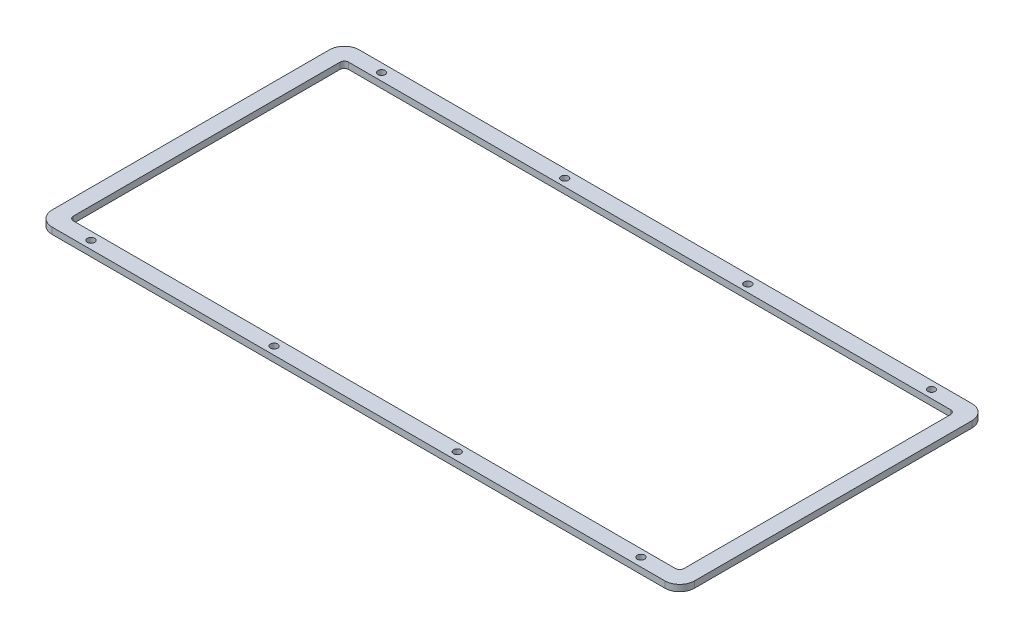
ISO-10303-21;
HEADER;
FILE_DESCRIPTION(('STEP AP214'),'2;1');
FILE_NAME('part.step','',(''),(''),'','','');
FILE_SCHEMA(('AUTOMOTIVE_DESIGN { 1 0 10303 214 1 1 1 1 }'));
ENDSEC;
DATA;
#1=APPLICATION_CONTEXT('core data for automotive mechanical design processes');
#2=APPLICATION_PROTOCOL_DEFINITION('international standard','automotive_design',2000,#1);
#3=PRODUCT_CONTEXT('',#1,'mechanical');
#4=PRODUCT('Part','Part','',(#3));
#5=PRODUCT_RELATED_PRODUCT_CATEGORY('part','',(#4));
#6=PRODUCT_DEFINITION_FORMATION('','',#4);
#7=PRODUCT_DEFINITION_CONTEXT('part definition',#1,'design');
#8=PRODUCT_DEFINITION('design','',#6,#7);
#9=PRODUCT_DEFINITION_SHAPE('','',#8);
#10=(LENGTH_UNIT() NAMED_UNIT(*) SI_UNIT(.MILLI.,.METRE.));
#11=(NAMED_UNIT(*) PLANE_ANGLE_UNIT() SI_UNIT($,.RADIAN.));
#12=(NAMED_UNIT(*) SI_UNIT($,.STERADIAN.) SOLID_ANGLE_UNIT());
#13=UNCERTAINTY_MEASURE_WITH_UNIT(LENGTH_MEASURE(1.E-05),#10,'distance_accuracy_value','');
#14=(GEOMETRIC_REPRESENTATION_CONTEXT(3) GLOBAL_UNCERTAINTY_ASSIGNED_CONTEXT((#13)) GLOBAL_UNIT_ASSIGNED_CONTEXT((#10,
#11,#12)) REPRESENTATION_CONTEXT('',''));
#15=CARTESIAN_POINT('',(0.,0.,0.));
#16=DIRECTION('',(0.,0.,1.));
#17=DIRECTION('',(1.,0.,0.));
#18=AXIS2_PLACEMENT_3D('',#15,#16,#17);
#19=CARTESIAN_POINT('',(0.,0.,0.));
#20=DIRECTION('',(0.,-1.,0.));
#21=DIRECTION('',(0.,0.,-1.));
#22=AXIS2_PLACEMENT_3D('',#19,#20,#21);
#23=PLANE('',#22);
#24=CARTESIAN_POINT('',(303.284579293257,0.,-34.6463811872234));
#25=DIRECTION('',(0.,-1.,0.));
#26=DIRECTION('',(0.,0.,-1.));
#27=AXIS2_PLACEMENT_3D('',#24,#25,#26);
#28=CIRCLE('',#27,1.69999999999992);
#29=CARTESIAN_POINT('',(303.284579293257,0.,-36.3463811872233));
#30=VERTEX_POINT('',#29);
#31=EDGE_CURVE('E43',#30,#30,#28,.T.);
#32=ORIENTED_EDGE('',*,*,#31,.F.);
#33=EDGE_LOOP('',(#32));
#34=FACE_BOUND('',#33,.T.);
#35=CARTESIAN_POINT('',(217.284579293257,0.,-34.3963811872234));
#36=DIRECTION('',(0.,-1.,0.));
#37=DIRECTION('',(0.,0.,-1.));
#38=AXIS2_PLACEMENT_3D('',#35,#36,#37);
#39=CIRCLE('',#38,1.70000000000001);
#40=CARTESIAN_POINT('',(217.284579293257,0.,-36.0963811872234));
#41=VERTEX_POINT('',#40);
#42=EDGE_CURVE('E318',#41,#41,#39,.T.);
#43=ORIENTED_EDGE('',*,*,#42,.F.);
#44=EDGE_LOOP('',(#43));
#45=FACE_BOUND('',#44,.T.);
#46=CARTESIAN_POINT('',(45.2845792932565,0.,-34.3963811872234));
#47=DIRECTION('',(0.,-1.,0.));
#48=DIRECTION('',(0.,0.,-1.));
#49=AXIS2_PLACEMENT_3D('',#46,#47,#48);
#50=CIRCLE('',#49,1.7);
#51=CARTESIAN_POINT('',(45.2845792932565,0.,-36.0963811872234));
#52=VERTEX_POINT('',#51);
#53=EDGE_CURVE('E316',#52,#52,#50,.T.);
#54=ORIENTED_EDGE('',*,*,#53,.F.);
#55=EDGE_LOOP('',(#54));
#56=FACE_BOUND('',#55,.T.);
#57=CARTESIAN_POINT('',(131.284579293257,0.,-34.3963811872234));
#58=DIRECTION('',(0.,-1.,0.));
#59=DIRECTION('',(0.,0.,-1.));
#60=AXIS2_PLACEMENT_3D('',#57,#58,#59);
#61=CIRCLE('',#60,1.70000000000001);
#62=CARTESIAN_POINT('',(131.284579293257,0.,-36.0963811872234));
#63=VERTEX_POINT('',#62);
#64=EDGE_CURVE('E313',#63,#63,#61,.T.);
#65=ORIENTED_EDGE('',*,*,#64,.F.);
#66=EDGE_LOOP('',(#65));
#67=FACE_BOUND('',#66,.T.);
#68=CARTESIAN_POINT('',(303.284579293257,0.,-171.095841187223));
#69=DIRECTION('',(0.,-1.,0.));
#70=DIRECTION('',(0.,0.,-1.));
#71=AXIS2_PLACEMENT_3D('',#68,#69,#70);
#72=CIRCLE('',#71,1.69999999999992);
#73=CARTESIAN_POINT('',(303.284579293257,0.,-172.795841187223));
#74=VERTEX_POINT('',#73);
#75=EDGE_CURVE('E310',#74,#74,#72,.T.);
#76=ORIENTED_EDGE('',*,*,#75,.F.);
#77=EDGE_LOOP('',(#76));
#78=FACE_BOUND('',#77,.T.);
#79=CARTESIAN_POINT('',(217.284579293257,0.,-170.845841187223));
#80=DIRECTION('',(0.,-1.,0.));
#81=DIRECTION('',(0.,0.,-1.));
#82=AXIS2_PLACEMENT_3D('',#79,#80,#81);
#83=CIRCLE('',#82,1.70000000000001);
#84=CARTESIAN_POINT('',(217.284579293257,0.,-172.545841187223));
#85=VERTEX_POINT('',#84);
#86=EDGE_CURVE('E307',#85,#85,#83,.T.);
#87=ORIENTED_EDGE('',*,*,#86,.F.);
#88=EDGE_LOOP('',(#87));
#89=FACE_BOUND('',#88,.T.);
#90=CARTESIAN_POINT('',(45.2845792932565,0.,-170.845841187223));
#91=DIRECTION('',(0.,-1.,0.));
#92=DIRECTION('',(0.,0.,-1.));
#93=AXIS2_PLACEMENT_3D('',#90,#91,#92);
#94=CIRCLE('',#93,1.7);
#95=CARTESIAN_POINT('',(45.2845792932565,0.,-172.545841187223));
#96=VERTEX_POINT('',#95);
#97=EDGE_CURVE('E304',#96,#96,#94,.T.);
#98=ORIENTED_EDGE('',*,*,#97,.F.);
#99=EDGE_LOOP('',(#98));
#100=FACE_BOUND('',#99,.T.);
#101=CARTESIAN_POINT('',(131.284579293257,0.,-170.845841187223));
#102=DIRECTION('',(0.,-1.,0.));
#103=DIRECTION('',(0.,0.,-1.));
#104=AXIS2_PLACEMENT_3D('',#101,#102,#103);
#105=CIRCLE('',#104,1.70000000000001);
#106=CARTESIAN_POINT('',(131.284579293257,0.,-172.545841187223));
#107=VERTEX_POINT('',#106);
#108=EDGE_CURVE('E254',#107,#107,#105,.T.);
#109=ORIENTED_EDGE('',*,*,#108,.F.);
#110=EDGE_LOOP('',(#109));
#111=FACE_BOUND('',#110,.T.);
#112=CARTESIAN_POINT('',(33.2845792932565,0.,-165.345841187223));
#113=DIRECTION('',(0.,-1.,0.));
#114=DIRECTION('',(0.,0.,-1.));
#115=AXIS2_PLACEMENT_3D('',#112,#113,#114);
#116=CIRCLE('',#115,2.);
#117=CARTESIAN_POINT('',(31.2845792932565,0.,-165.345841187223));
#118=VERTEX_POINT('',#117);
#119=CARTESIAN_POINT('',(33.2845792932565,0.,-167.345841187223));
#120=VERTEX_POINT('',#119);
#121=EDGE_CURVE('E283',#118,#120,#116,.T.);
#122=ORIENTED_EDGE('',*,*,#121,.F.);
#123=DIRECTION('',(0.,0.,-1.));
#124=VECTOR('',#123,1.);
#125=CARTESIAN_POINT('',(31.2845792932565,0.,0.));
#126=LINE('',#125,#124);
#127=CARTESIAN_POINT('',(31.2845792932565,0.,-40.1463811872234));
#128=VERTEX_POINT('',#127);
#129=EDGE_CURVE('E268',#128,#118,#126,.T.);
#130=ORIENTED_EDGE('',*,*,#129,.F.);
#131=CARTESIAN_POINT('',(33.2845792932565,0.,-40.1463811872234));
#132=DIRECTION('',(0.,-1.,0.));
#133=DIRECTION('',(0.,0.,-1.));
#134=AXIS2_PLACEMENT_3D('',#131,#132,#133);
#135=CIRCLE('',#134,2.);
#136=CARTESIAN_POINT('',(33.2845792932565,0.,-38.1463811872234));
#137=VERTEX_POINT('',#136);
#138=EDGE_CURVE('E270',#137,#128,#135,.T.);
#139=ORIENTED_EDGE('',*,*,#138,.F.);
#140=DIRECTION('',(-1.,0.,0.));
#141=VECTOR('',#140,1.);
#142=CARTESIAN_POINT('',(0.,0.,-38.1463811872234));
#143=LINE('',#142,#141);
#144=CARTESIAN_POINT('',(315.983929293256,0.,-38.1463811872234));
#145=VERTEX_POINT('',#144);
#146=EDGE_CURVE('E273',#145,#137,#143,.T.);
#147=ORIENTED_EDGE('',*,*,#146,.F.);
#148=CARTESIAN_POINT('',(315.983929293256,0.,-40.1463811872234));
#149=DIRECTION('',(0.,-1.,0.));
#150=DIRECTION('',(0.,0.,-1.));
#151=AXIS2_PLACEMENT_3D('',#148,#149,#150);
#152=CIRCLE('',#151,2.);
#153=CARTESIAN_POINT('',(317.983929293256,0.,-40.1463811872234));
#154=VERTEX_POINT('',#153);
#155=EDGE_CURVE('E275',#154,#145,#152,.T.);
#156=ORIENTED_EDGE('',*,*,#155,.F.);
#157=DIRECTION('',(0.,0.,1.));
#158=VECTOR('',#157,1.);
#159=CARTESIAN_POINT('',(317.983929293256,0.,0.));
#160=LINE('',#159,#158);
#161=CARTESIAN_POINT('',(317.983929293256,0.,-165.345841187223));
#162=VERTEX_POINT('',#161);
#163=EDGE_CURVE('E277',#162,#154,#160,.T.);
#164=ORIENTED_EDGE('',*,*,#163,.F.);
#165=CARTESIAN_POINT('',(315.983929293256,0.,-165.345841187223));
#166=DIRECTION('',(0.,-1.,0.));
#167=DIRECTION('',(0.,0.,-1.));
#168=AXIS2_PLACEMENT_3D('',#165,#166,#167);
#169=CIRCLE('',#168,2.);
#170=CARTESIAN_POINT('',(315.983929293256,0.,-167.345841187223));
#171=VERTEX_POINT('',#170);
#172=EDGE_CURVE('E279',#171,#162,#169,.T.);
#173=ORIENTED_EDGE('',*,*,#172,.F.);
#174=DIRECTION('',(1.,0.,0.));
#175=VECTOR('',#174,1.);
#176=CARTESIAN_POINT('',(0.,0.,-167.345841187223));
#177=LINE('',#176,#175);
#178=EDGE_CURVE('E281',#120,#171,#177,.T.);
#179=ORIENTED_EDGE('',*,*,#178,.F.);
#180=EDGE_LOOP('',(#122,#130,#139,#147,#156,#164,#173,#179));
#181=FACE_BOUND('',#180,.T.);
#182=DIRECTION('',(0.,0.,-1.));
#183=VECTOR('',#182,1.);
#184=CARTESIAN_POINT('',(23.7845792932565,0.,0.));
#185=LINE('',#184,#183);
#186=CARTESIAN_POINT('',(23.7845792932565,0.,-37.6463811872234));
#187=VERTEX_POINT('',#186);
#188=CARTESIAN_POINT('',(23.7845792932565,0.,-167.845841187223));
#189=VERTEX_POINT('',#188);
#190=EDGE_CURVE('E285',#187,#189,#185,.T.);
#191=ORIENTED_EDGE('',*,*,#190,.T.);
#192=CARTESIAN_POINT('',(30.7845792932565,0.,-167.845841187223));
#193=DIRECTION('',(0.,-1.,0.));
#194=DIRECTION('',(0.,0.,-1.));
#195=AXIS2_PLACEMENT_3D('',#192,#193,#194);
#196=CIRCLE('',#195,7.);
#197=CARTESIAN_POINT('',(30.7845792932565,0.,-174.845841187223));
#198=VERTEX_POINT('',#197);
#199=EDGE_CURVE('E12',#189,#198,#196,.T.);
#200=ORIENTED_EDGE('',*,*,#199,.T.);
#201=DIRECTION('',(1.,0.,0.));
#202=VECTOR('',#201,1.);
#203=CARTESIAN_POINT('',(0.,0.,-174.845841187223));
#204=LINE('',#203,#202);
#205=CARTESIAN_POINT('',(318.483929293257,0.,-174.845841187223));
#206=VERTEX_POINT('',#205);
#207=EDGE_CURVE('E48',#198,#206,#204,.T.);
#208=ORIENTED_EDGE('',*,*,#207,.T.);
#209=CARTESIAN_POINT('',(318.483929293257,0.,-167.845841187223));
#210=DIRECTION('',(0.,-1.,0.));
#211=DIRECTION('',(0.,0.,-1.));
#212=AXIS2_PLACEMENT_3D('',#209,#210,#211);
#213=CIRCLE('',#212,7.00000000000001);
#214=CARTESIAN_POINT('',(325.483929293257,0.,-167.845841187223));
#215=VERTEX_POINT('',#214);
#216=EDGE_CURVE('E297',#206,#215,#213,.T.);
#217=ORIENTED_EDGE('',*,*,#216,.T.);
#218=DIRECTION('',(0.,0.,1.));
#219=VECTOR('',#218,1.);
#220=CARTESIAN_POINT('',(325.483929293257,0.,0.));
#221=LINE('',#220,#219);
#222=CARTESIAN_POINT('',(325.483929293257,0.,-37.6463811872234));
#223=VERTEX_POINT('',#222);
#224=EDGE_CURVE('E294',#215,#223,#221,.T.);
#225=ORIENTED_EDGE('',*,*,#224,.T.);
#226=CARTESIAN_POINT('',(318.483929293257,0.,-37.6463811872234));
#227=DIRECTION('',(0.,-1.,0.));
#228=DIRECTION('',(0.,0.,-1.));
#229=AXIS2_PLACEMENT_3D('',#226,#227,#228);
#230=CIRCLE('',#229,7.);
#231=CARTESIAN_POINT('',(318.483929293257,0.,-30.6463811872234));
#232=VERTEX_POINT('',#231);
#233=EDGE_CURVE('E291',#223,#232,#230,.T.);
#234=ORIENTED_EDGE('',*,*,#233,.T.);
#235=DIRECTION('',(-1.,0.,0.));
#236=VECTOR('',#235,1.);
#237=CARTESIAN_POINT('',(0.,0.,-30.6463811872234));
#238=LINE('',#237,#236);
#239=CARTESIAN_POINT('',(30.7845792932565,0.,-30.6463811872234));
#240=VERTEX_POINT('',#239);
#241=EDGE_CURVE('E289',#232,#240,#238,.T.);
#242=ORIENTED_EDGE('',*,*,#241,.T.);
#243=CARTESIAN_POINT('',(30.7845792932565,0.,-37.6463811872234));
#244=DIRECTION('',(0.,-1.,0.));
#245=DIRECTION('',(0.,0.,-1.));
#246=AXIS2_PLACEMENT_3D('',#243,#244,#245);
#247=CIRCLE('',#246,7.);
#248=EDGE_CURVE('E158',#240,#187,#247,.T.);
#249=ORIENTED_EDGE('',*,*,#248,.T.);
#250=EDGE_LOOP('',(#191,#200,#208,#217,#225,#234,#242,#249));
#251=FACE_BOUND('',#250,.T.);
#252=ADVANCED_FACE('F40',(#34,#45,#56,#67,#78,#89,#100,#111,#181,#251),#23,.T.);
#253=CARTESIAN_POINT('',(33.2845792932565,-7.,-165.345841187223));
#254=DIRECTION('',(0.,1.,0.));
#255=DIRECTION('',(0.,0.,1.));
#256=AXIS2_PLACEMENT_3D('',#253,#254,#255);
#257=CYLINDRICAL_SURFACE('',#256,2.);
#258=ORIENTED_EDGE('',*,*,#121,.T.);
#259=DIRECTION('',(0.,1.,0.));
#260=VECTOR('',#259,1.);
#261=CARTESIAN_POINT('',(33.2845792932565,-7.,-167.345841187223));
#262=LINE('',#261,#260);
#263=CARTESIAN_POINT('',(33.2845792932565,3.,-167.345841187223));
#264=VERTEX_POINT('',#263);
#265=EDGE_CURVE('E252',#120,#264,#262,.T.);
#266=ORIENTED_EDGE('',*,*,#265,.T.);
#267=CARTESIAN_POINT('',(33.2845792932565,3.,-165.345841187223));
#268=DIRECTION('',(0.,1.,0.));
#269=DIRECTION('',(0.,0.,1.));
#270=AXIS2_PLACEMENT_3D('',#267,#268,#269);
#271=CIRCLE('',#270,2.);
#272=CARTESIAN_POINT('',(31.2845792932565,3.,-165.345841187223));
#273=VERTEX_POINT('',#272);
#274=EDGE_CURVE('E64',#264,#273,#271,.T.);
#275=ORIENTED_EDGE('',*,*,#274,.T.);
#276=DIRECTION('',(0.,1.,0.));
#277=VECTOR('',#276,1.);
#278=CARTESIAN_POINT('',(31.2845792932565,-7.,-165.345841187223));
#279=LINE('',#278,#277);
#280=EDGE_CURVE('E251',#118,#273,#279,.T.);
#281=ORIENTED_EDGE('',*,*,#280,.F.);
#282=EDGE_LOOP('',(#258,#266,#275,#281));
#283=FACE_BOUND('',#282,.T.);
#284=ADVANCED_FACE('F330',(#283),#257,.F.);
#285=CARTESIAN_POINT('',(33.2845792932565,-7.,-167.345841187223));
#286=DIRECTION('',(0.,0.,-1.));
#287=DIRECTION('',(-1.,0.,0.));
#288=AXIS2_PLACEMENT_3D('',#285,#286,#287);
#289=PLANE('',#288);
#290=ORIENTED_EDGE('',*,*,#178,.T.);
#291=DIRECTION('',(0.,1.,0.));
#292=VECTOR('',#291,1.);
#293=CARTESIAN_POINT('',(315.983929293256,-7.,-167.345841187223));
#294=LINE('',#293,#292);
#295=CARTESIAN_POINT('',(315.983929293256,3.,-167.345841187223));
#296=VERTEX_POINT('',#295);
#297=EDGE_CURVE('E255',#171,#296,#294,.T.);
#298=ORIENTED_EDGE('',*,*,#297,.T.);
#299=DIRECTION('',(-1.,0.,0.));
#300=VECTOR('',#299,1.);
#301=CARTESIAN_POINT('',(33.2845792932565,3.,-167.345841187223));
#302=LINE('',#301,#300);
#303=EDGE_CURVE('E248',#296,#264,#302,.T.);
#304=ORIENTED_EDGE('',*,*,#303,.T.);
#305=ORIENTED_EDGE('',*,*,#265,.F.);
#306=EDGE_LOOP('',(#290,#298,#304,#305));
#307=FACE_BOUND('',#306,.T.);
#308=ADVANCED_FACE('F415',(#307),#289,.F.);
#309=CARTESIAN_POINT('',(315.983929293256,-7.,-165.345841187223));
#310=DIRECTION('',(0.,1.,0.));
#311=DIRECTION('',(0.,0.,1.));
#312=AXIS2_PLACEMENT_3D('',#309,#310,#311);
#313=CYLINDRICAL_SURFACE('',#312,2.);
#314=ORIENTED_EDGE('',*,*,#172,.T.);
#315=DIRECTION('',(0.,1.,0.));
#316=VECTOR('',#315,1.);
#317=CARTESIAN_POINT('',(317.983929293256,-7.,-165.345841187223));
#318=LINE('',#317,#316);
#319=CARTESIAN_POINT('',(317.983929293256,3.,-165.345841187223));
#320=VERTEX_POINT('',#319);
#321=EDGE_CURVE('E257',#162,#320,#318,.T.);
#322=ORIENTED_EDGE('',*,*,#321,.T.);
#323=CARTESIAN_POINT('',(315.983929293256,3.,-165.345841187223));
#324=DIRECTION('',(0.,1.,0.));
#325=DIRECTION('',(0.,0.,1.));
#326=AXIS2_PLACEMENT_3D('',#323,#324,#325);
#327=CIRCLE('',#326,2.);
#328=EDGE_CURVE('E245',#320,#296,#327,.T.);
#329=ORIENTED_EDGE('',*,*,#328,.T.);
#330=ORIENTED_EDGE('',*,*,#297,.F.);
#331=EDGE_LOOP('',(#314,#322,#329,#330));
#332=FACE_BOUND('',#331,.T.);
#333=ADVANCED_FACE('F418',(#332),#313,.F.);
#334=CARTESIAN_POINT('',(317.983929293256,-7.,-165.345841187223));
#335=DIRECTION('',(1.,0.,0.));
#336=DIRECTION('',(0.,0.,-1.));
#337=AXIS2_PLACEMENT_3D('',#334,#335,#336);
#338=PLANE('',#337);
#339=ORIENTED_EDGE('',*,*,#163,.T.);
#340=DIRECTION('',(0.,1.,0.));
#341=VECTOR('',#340,1.);
#342=CARTESIAN_POINT('',(317.983929293256,-7.,-40.1463811872234));
#343=LINE('',#342,#341);
#344=CARTESIAN_POINT('',(317.983929293256,3.,-40.1463811872234));
#345=VERTEX_POINT('',#344);
#346=EDGE_CURVE('E259',#154,#345,#343,.T.);
#347=ORIENTED_EDGE('',*,*,#346,.T.);
#348=DIRECTION('',(0.,0.,-1.));
#349=VECTOR('',#348,1.);
#350=CARTESIAN_POINT('',(317.983929293256,3.,-165.345841187223));
#351=LINE('',#350,#349);
#352=EDGE_CURVE('E242',#345,#320,#351,.T.);
#353=ORIENTED_EDGE('',*,*,#352,.T.);
#354=ORIENTED_EDGE('',*,*,#321,.F.);
#355=EDGE_LOOP('',(#339,#347,#353,#354));
#356=FACE_BOUND('',#355,.T.);
#357=ADVANCED_FACE('F422',(#356),#338,.F.);
#358=CARTESIAN_POINT('',(315.983929293256,-7.,-40.1463811872234));
#359=DIRECTION('',(0.,1.,0.));
#360=DIRECTION('',(0.,0.,1.));
#361=AXIS2_PLACEMENT_3D('',#358,#359,#360);
#362=CYLINDRICAL_SURFACE('',#361,2.);
#363=ORIENTED_EDGE('',*,*,#155,.T.);
#364=DIRECTION('',(0.,1.,0.));
#365=VECTOR('',#364,1.);
#366=CARTESIAN_POINT('',(315.983929293256,-7.,-38.1463811872234));
#367=LINE('',#366,#365);
#368=CARTESIAN_POINT('',(315.983929293256,3.,-38.1463811872234));
#369=VERTEX_POINT('',#368);
#370=EDGE_CURVE('E261',#145,#369,#367,.T.);
#371=ORIENTED_EDGE('',*,*,#370,.T.);
#372=CARTESIAN_POINT('',(315.983929293256,3.,-40.1463811872234));
#373=DIRECTION('',(0.,1.,0.));
#374=DIRECTION('',(0.,0.,1.));
#375=AXIS2_PLACEMENT_3D('',#372,#373,#374);
#376=CIRCLE('',#375,2.);
#377=EDGE_CURVE('E239',#369,#345,#376,.T.);
#378=ORIENTED_EDGE('',*,*,#377,.T.);
#379=ORIENTED_EDGE('',*,*,#346,.F.);
#380=EDGE_LOOP('',(#363,#371,#378,#379));
#381=FACE_BOUND('',#380,.T.);
#382=ADVANCED_FACE('F426',(#381),#362,.F.);
#383=CARTESIAN_POINT('',(315.983929293256,-7.,-38.1463811872234));
#384=DIRECTION('',(0.,0.,1.));
#385=DIRECTION('',(1.,0.,0.));
#386=AXIS2_PLACEMENT_3D('',#383,#384,#385);
#387=PLANE('',#386);
#388=ORIENTED_EDGE('',*,*,#146,.T.);
#389=DIRECTION('',(0.,1.,0.));
#390=VECTOR('',#389,1.);
#391=CARTESIAN_POINT('',(33.2845792932565,-7.,-38.1463811872234));
#392=LINE('',#391,#390);
#393=CARTESIAN_POINT('',(33.2845792932565,3.,-38.1463811872234));
#394=VERTEX_POINT('',#393);
#395=EDGE_CURVE('E263',#137,#394,#392,.T.);
#396=ORIENTED_EDGE('',*,*,#395,.T.);
#397=DIRECTION('',(1.,0.,0.));
#398=VECTOR('',#397,1.);
#399=CARTESIAN_POINT('',(315.983929293256,3.,-38.1463811872234));
#400=LINE('',#399,#398);
#401=EDGE_CURVE('E236',#394,#369,#400,.T.);
#402=ORIENTED_EDGE('',*,*,#401,.T.);
#403=ORIENTED_EDGE('',*,*,#370,.F.);
#404=EDGE_LOOP('',(#388,#396,#402,#403));
#405=FACE_BOUND('',#404,.T.);
#406=ADVANCED_FACE('F430',(#405),#387,.F.);
#407=CARTESIAN_POINT('',(33.2845792932565,-7.,-40.1463811872234));
#408=DIRECTION('',(0.,1.,0.));
#409=DIRECTION('',(0.,0.,1.));
#410=AXIS2_PLACEMENT_3D('',#407,#408,#409);
#411=CYLINDRICAL_SURFACE('',#410,2.);
#412=ORIENTED_EDGE('',*,*,#138,.T.);
#413=DIRECTION('',(0.,1.,0.));
#414=VECTOR('',#413,1.);
#415=CARTESIAN_POINT('',(31.2845792932565,-7.,-40.1463811872234));
#416=LINE('',#415,#414);
#417=CARTESIAN_POINT('',(31.2845792932565,3.,-40.1463811872234));
#418=VERTEX_POINT('',#417);
#419=EDGE_CURVE('E265',#128,#418,#416,.T.);
#420=ORIENTED_EDGE('',*,*,#419,.T.);
#421=CARTESIAN_POINT('',(33.2845792932565,3.,-40.1463811872234));
#422=DIRECTION('',(0.,1.,0.));
#423=DIRECTION('',(0.,0.,1.));
#424=AXIS2_PLACEMENT_3D('',#421,#422,#423);
#425=CIRCLE('',#424,2.);
#426=EDGE_CURVE('E233',#418,#394,#425,.T.);
#427=ORIENTED_EDGE('',*,*,#426,.T.);
#428=ORIENTED_EDGE('',*,*,#395,.F.);
#429=EDGE_LOOP('',(#412,#420,#427,#428));
#430=FACE_BOUND('',#429,.T.);
#431=ADVANCED_FACE('F434',(#430),#411,.F.);
#432=CARTESIAN_POINT('',(31.2845792932565,-7.,-40.1463811872234));
#433=DIRECTION('',(-1.,0.,0.));
#434=DIRECTION('',(0.,0.,1.));
#435=AXIS2_PLACEMENT_3D('',#432,#433,#434);
#436=PLANE('',#435);
#437=ORIENTED_EDGE('',*,*,#129,.T.);
#438=ORIENTED_EDGE('',*,*,#280,.T.);
#439=DIRECTION('',(0.,0.,1.));
#440=VECTOR('',#439,1.);
#441=CARTESIAN_POINT('',(31.2845792932565,3.,-40.1463811872234));
#442=LINE('',#441,#440);
#443=EDGE_CURVE('E230',#273,#418,#442,.T.);
#444=ORIENTED_EDGE('',*,*,#443,.T.);
#445=ORIENTED_EDGE('',*,*,#419,.F.);
#446=EDGE_LOOP('',(#437,#438,#444,#445));
#447=FACE_BOUND('',#446,.T.);
#448=ADVANCED_FACE('F386',(#447),#436,.F.);
#449=CARTESIAN_POINT('',(30.7845792932565,-7.,-167.845841187223));
#450=DIRECTION('',(0.,1.,0.));
#451=DIRECTION('',(0.,0.,1.));
#452=AXIS2_PLACEMENT_3D('',#449,#450,#451);
#453=CYLINDRICAL_SURFACE('',#452,7.);
#454=DIRECTION('',(0.,1.,0.));
#455=VECTOR('',#454,1.);
#456=CARTESIAN_POINT('',(23.7845792932565,-7.,-167.845841187223));
#457=LINE('',#456,#455);
#458=CARTESIAN_POINT('',(23.7845792932565,3.,-167.845841187223));
#459=VERTEX_POINT('',#458);
#460=EDGE_CURVE('E193',#189,#459,#457,.T.);
#461=ORIENTED_EDGE('',*,*,#460,.T.);
#462=CARTESIAN_POINT('',(30.7845792932565,3.,-167.845841187223));
#463=DIRECTION('',(0.,1.,0.));
#464=DIRECTION('',(0.,0.,1.));
#465=AXIS2_PLACEMENT_3D('',#462,#463,#464);
#466=CIRCLE('',#465,7.);
#467=CARTESIAN_POINT('',(30.7845792932565,3.,-174.845841187223));
#468=VERTEX_POINT('',#467);
#469=EDGE_CURVE('E179',#468,#459,#466,.T.);
#470=ORIENTED_EDGE('',*,*,#469,.F.);
#471=DIRECTION('',(0.,1.,0.));
#472=VECTOR('',#471,1.);
#473=CARTESIAN_POINT('',(30.7845792932565,-7.,-174.845841187223));
#474=LINE('',#473,#472);
#475=EDGE_CURVE('E194',#198,#468,#474,.T.);
#476=ORIENTED_EDGE('',*,*,#475,.F.);
#477=ORIENTED_EDGE('',*,*,#199,.F.);
#478=EDGE_LOOP('',(#461,#470,#476,#477));
#479=FACE_BOUND('',#478,.T.);
#480=ADVANCED_FACE('F354',(#479),#453,.T.);
#481=CARTESIAN_POINT('',(30.7845792932565,-7.,-174.845841187223));
#482=DIRECTION('',(0.,0.,-1.));
#483=DIRECTION('',(-1.,0.,0.));
#484=AXIS2_PLACEMENT_3D('',#481,#482,#483);
#485=PLANE('',#484);
#486=ORIENTED_EDGE('',*,*,#475,.T.);
#487=DIRECTION('',(-1.,0.,0.));
#488=VECTOR('',#487,1.);
#489=CARTESIAN_POINT('',(30.7845792932565,3.,-174.845841187223));
#490=LINE('',#489,#488);
#491=CARTESIAN_POINT('',(318.483929293257,3.,-174.845841187223));
#492=VERTEX_POINT('',#491);
#493=EDGE_CURVE('E190',#492,#468,#490,.T.);
#494=ORIENTED_EDGE('',*,*,#493,.F.);
#495=DIRECTION('',(0.,1.,0.));
#496=VECTOR('',#495,1.);
#497=CARTESIAN_POINT('',(318.483929293257,-7.,-174.845841187223));
#498=LINE('',#497,#496);
#499=EDGE_CURVE('E197',#206,#492,#498,.T.);
#500=ORIENTED_EDGE('',*,*,#499,.F.);
#501=ORIENTED_EDGE('',*,*,#207,.F.);
#502=EDGE_LOOP('',(#486,#494,#500,#501));
#503=FACE_BOUND('',#502,.T.);
#504=ADVANCED_FACE('F357',(#503),#485,.T.);
#505=CARTESIAN_POINT('',(318.483929293257,-7.,-167.845841187223));
#506=DIRECTION('',(0.,1.,0.));
#507=DIRECTION('',(0.,0.,1.));
#508=AXIS2_PLACEMENT_3D('',#505,#506,#507);
#509=CYLINDRICAL_SURFACE('',#508,7.00000000000001);
#510=ORIENTED_EDGE('',*,*,#499,.T.);
#511=CARTESIAN_POINT('',(318.483929293257,3.,-167.845841187223));
#512=DIRECTION('',(0.,1.,0.));
#513=DIRECTION('',(0.,0.,1.));
#514=AXIS2_PLACEMENT_3D('',#511,#512,#513);
#515=CIRCLE('',#514,7.00000000000001);
#516=CARTESIAN_POINT('',(325.483929293257,3.,-167.845841187223));
#517=VERTEX_POINT('',#516);
#518=EDGE_CURVE('E187',#517,#492,#515,.T.);
#519=ORIENTED_EDGE('',*,*,#518,.F.);
#520=DIRECTION('',(0.,1.,0.));
#521=VECTOR('',#520,1.);
#522=CARTESIAN_POINT('',(325.483929293257,-7.,-167.845841187223));
#523=LINE('',#522,#521);
#524=EDGE_CURVE('E199',#215,#517,#523,.T.);
#525=ORIENTED_EDGE('',*,*,#524,.F.);
#526=ORIENTED_EDGE('',*,*,#216,.F.);
#527=EDGE_LOOP('',(#510,#519,#525,#526));
#528=FACE_BOUND('',#527,.T.);
#529=ADVANCED_FACE('F361',(#528),#509,.T.);
#530=CARTESIAN_POINT('',(325.483929293257,-7.,-167.845841187223));
#531=DIRECTION('',(1.,0.,0.));
#532=DIRECTION('',(0.,0.,-1.));
#533=AXIS2_PLACEMENT_3D('',#530,#531,#532);
#534=PLANE('',#533);
#535=ORIENTED_EDGE('',*,*,#524,.T.);
#536=DIRECTION('',(0.,0.,-1.));
#537=VECTOR('',#536,1.);
#538=CARTESIAN_POINT('',(325.483929293257,3.,-167.845841187223));
#539=LINE('',#538,#537);
#540=CARTESIAN_POINT('',(325.483929293257,3.,-37.6463811872234));
#541=VERTEX_POINT('',#540);
#542=EDGE_CURVE('E184',#541,#517,#539,.T.);
#543=ORIENTED_EDGE('',*,*,#542,.F.);
#544=DIRECTION('',(0.,1.,0.));
#545=VECTOR('',#544,1.);
#546=CARTESIAN_POINT('',(325.483929293257,-7.,-37.6463811872234));
#547=LINE('',#546,#545);
#548=EDGE_CURVE('E201',#223,#541,#547,.T.);
#549=ORIENTED_EDGE('',*,*,#548,.F.);
#550=ORIENTED_EDGE('',*,*,#224,.F.);
#551=EDGE_LOOP('',(#535,#543,#549,#550));
#552=FACE_BOUND('',#551,.T.);
#553=ADVANCED_FACE('F365',(#552),#534,.T.);
#554=CARTESIAN_POINT('',(318.483929293257,-7.,-37.6463811872234));
#555=DIRECTION('',(0.,1.,0.));
#556=DIRECTION('',(0.,0.,1.));
#557=AXIS2_PLACEMENT_3D('',#554,#555,#556);
#558=CYLINDRICAL_SURFACE('',#557,7.);
#559=ORIENTED_EDGE('',*,*,#548,.T.);
#560=CARTESIAN_POINT('',(318.483929293257,3.,-37.6463811872234));
#561=DIRECTION('',(0.,1.,0.));
#562=DIRECTION('',(0.,0.,1.));
#563=AXIS2_PLACEMENT_3D('',#560,#561,#562);
#564=CIRCLE('',#563,7.);
#565=CARTESIAN_POINT('',(318.483929293257,3.,-30.6463811872234));
#566=VERTEX_POINT('',#565);
#567=EDGE_CURVE('E171',#566,#541,#564,.T.);
#568=ORIENTED_EDGE('',*,*,#567,.F.);
#569=DIRECTION('',(0.,1.,0.));
#570=VECTOR('',#569,1.);
#571=CARTESIAN_POINT('',(318.483929293257,-7.,-30.6463811872234));
#572=LINE('',#571,#570);
#573=EDGE_CURVE('E161',#232,#566,#572,.T.);
#574=ORIENTED_EDGE('',*,*,#573,.F.);
#575=ORIENTED_EDGE('',*,*,#233,.F.);
#576=EDGE_LOOP('',(#559,#568,#574,#575));
#577=FACE_BOUND('',#576,.T.);
#578=ADVANCED_FACE('F368',(#577),#558,.T.);
#579=CARTESIAN_POINT('',(318.483929293257,-7.,-30.6463811872234));
#580=DIRECTION('',(0.,0.,1.));
#581=DIRECTION('',(1.,0.,0.));
#582=AXIS2_PLACEMENT_3D('',#579,#580,#581);
#583=PLANE('',#582);
#584=ORIENTED_EDGE('',*,*,#573,.T.);
#585=DIRECTION('',(1.,0.,0.));
#586=VECTOR('',#585,1.);
#587=CARTESIAN_POINT('',(318.483929293257,3.,-30.6463811872234));
#588=LINE('',#587,#586);
#589=CARTESIAN_POINT('',(30.7845792932565,3.,-30.6463811872234));
#590=VERTEX_POINT('',#589);
#591=EDGE_CURVE('E165',#590,#566,#588,.T.);
#592=ORIENTED_EDGE('',*,*,#591,.F.);
#593=DIRECTION('',(0.,1.,0.));
#594=VECTOR('',#593,1.);
#595=CARTESIAN_POINT('',(30.7845792932565,-7.,-30.6463811872234));
#596=LINE('',#595,#594);
#597=EDGE_CURVE('E154',#240,#590,#596,.T.);
#598=ORIENTED_EDGE('',*,*,#597,.F.);
#599=ORIENTED_EDGE('',*,*,#241,.F.);
#600=EDGE_LOOP('',(#584,#592,#598,#599));
#601=FACE_BOUND('',#600,.T.);
#602=ADVANCED_FACE('F166',(#601),#583,.T.);
#603=CARTESIAN_POINT('',(30.7845792932565,-7.,-37.6463811872234));
#604=DIRECTION('',(0.,1.,0.));
#605=DIRECTION('',(0.,0.,1.));
#606=AXIS2_PLACEMENT_3D('',#603,#604,#605);
#607=CYLINDRICAL_SURFACE('',#606,7.);
#608=ORIENTED_EDGE('',*,*,#597,.T.);
#609=CARTESIAN_POINT('',(30.7845792932565,3.,-37.6463811872234));
#610=DIRECTION('',(0.,1.,0.));
#611=DIRECTION('',(0.,0.,1.));
#612=AXIS2_PLACEMENT_3D('',#609,#610,#611);
#613=CIRCLE('',#612,7.);
#614=CARTESIAN_POINT('',(23.7845792932565,3.,-37.6463811872234));
#615=VERTEX_POINT('',#614);
#616=EDGE_CURVE('E56',#615,#590,#613,.T.);
#617=ORIENTED_EDGE('',*,*,#616,.F.);
#618=DIRECTION('',(0.,1.,0.));
#619=VECTOR('',#618,1.);
#620=CARTESIAN_POINT('',(23.7845792932565,-7.,-37.6463811872234));
#621=LINE('',#620,#619);
#622=EDGE_CURVE('E162',#187,#615,#621,.T.);
#623=ORIENTED_EDGE('',*,*,#622,.F.);
#624=ORIENTED_EDGE('',*,*,#248,.F.);
#625=EDGE_LOOP('',(#608,#617,#623,#624));
#626=FACE_BOUND('',#625,.T.);
#627=ADVANCED_FACE('F156',(#626),#607,.T.);
#628=CARTESIAN_POINT('',(23.7845792932565,-7.,-37.6463811872234));
#629=DIRECTION('',(-1.,0.,0.));
#630=DIRECTION('',(0.,0.,1.));
#631=AXIS2_PLACEMENT_3D('',#628,#629,#630);
#632=PLANE('',#631);
#633=ORIENTED_EDGE('',*,*,#622,.T.);
#634=DIRECTION('',(0.,0.,1.));
#635=VECTOR('',#634,1.);
#636=CARTESIAN_POINT('',(23.7845792932565,3.,-37.6463811872234));
#637=LINE('',#636,#635);
#638=EDGE_CURVE('E177',#459,#615,#637,.T.);
#639=ORIENTED_EDGE('',*,*,#638,.F.);
#640=ORIENTED_EDGE('',*,*,#460,.F.);
#641=ORIENTED_EDGE('',*,*,#190,.F.);
#642=EDGE_LOOP('',(#633,#639,#640,#641));
#643=FACE_BOUND('',#642,.T.);
#644=ADVANCED_FACE('F350',(#643),#632,.T.);
#645=CARTESIAN_POINT('',(131.284579293257,-7.,-170.845841187223));
#646=DIRECTION('',(0.,1.,0.));
#647=DIRECTION('',(0.,0.,1.));
#648=AXIS2_PLACEMENT_3D('',#645,#646,#647);
#649=CYLINDRICAL_SURFACE('',#648,1.70000000000001);
#650=ORIENTED_EDGE('',*,*,#108,.T.);
#651=EDGE_LOOP('',(#650));
#652=FACE_BOUND('',#651,.T.);
#653=CARTESIAN_POINT('',(131.284579293257,3.,-170.845841187223));
#654=DIRECTION('',(0.,1.,0.));
#655=DIRECTION('',(0.,0.,1.));
#656=AXIS2_PLACEMENT_3D('',#653,#654,#655);
#657=CIRCLE('',#656,1.70000000000001);
#658=CARTESIAN_POINT('',(131.284579293257,3.,-169.145841187223));
#659=VERTEX_POINT('',#658);
#660=EDGE_CURVE('E196',#659,#659,#657,.T.);
#661=ORIENTED_EDGE('',*,*,#660,.T.);
#662=EDGE_LOOP('',(#661));
#663=FACE_BOUND('',#662,.T.);
#664=ADVANCED_FACE('F383',(#652,#663),#649,.F.);
#665=CARTESIAN_POINT('',(45.2845792932565,-7.,-170.845841187223));
#666=DIRECTION('',(0.,1.,0.));
#667=DIRECTION('',(0.,0.,1.));
#668=AXIS2_PLACEMENT_3D('',#665,#666,#667);
#669=CYLINDRICAL_SURFACE('',#668,1.7);
#670=ORIENTED_EDGE('',*,*,#97,.T.);
#671=EDGE_LOOP('',(#670));
#672=FACE_BOUND('',#671,.T.);
#673=CARTESIAN_POINT('',(45.2845792932565,3.,-170.845841187223));
#674=DIRECTION('',(0.,1.,0.));
#675=DIRECTION('',(0.,0.,1.));
#676=AXIS2_PLACEMENT_3D('',#673,#674,#675);
#677=CIRCLE('',#676,1.7);
#678=CARTESIAN_POINT('',(45.2845792932565,3.,-169.145841187223));
#679=VERTEX_POINT('',#678);
#680=EDGE_CURVE('E224',#679,#679,#677,.T.);
#681=ORIENTED_EDGE('',*,*,#680,.T.);
#682=EDGE_LOOP('',(#681));
#683=FACE_BOUND('',#682,.T.);
#684=ADVANCED_FACE('F407',(#672,#683),#669,.F.);
#685=CARTESIAN_POINT('',(217.284579293257,-7.,-170.845841187223));
#686=DIRECTION('',(0.,1.,0.));
#687=DIRECTION('',(0.,0.,1.));
#688=AXIS2_PLACEMENT_3D('',#685,#686,#687);
#689=CYLINDRICAL_SURFACE('',#688,1.70000000000001);
#690=ORIENTED_EDGE('',*,*,#86,.T.);
#691=EDGE_LOOP('',(#690));
#692=FACE_BOUND('',#691,.T.);
#693=CARTESIAN_POINT('',(217.284579293257,3.,-170.845841187223));
#694=DIRECTION('',(0.,1.,0.));
#695=DIRECTION('',(0.,0.,1.));
#696=AXIS2_PLACEMENT_3D('',#693,#694,#695);
#697=CIRCLE('',#696,1.70000000000001);
#698=CARTESIAN_POINT('',(217.284579293257,3.,-169.145841187223));
#699=VERTEX_POINT('',#698);
#700=EDGE_CURVE('E221',#699,#699,#697,.T.);
#701=ORIENTED_EDGE('',*,*,#700,.T.);
#702=EDGE_LOOP('',(#701));
#703=FACE_BOUND('',#702,.T.);
#704=ADVANCED_FACE('F403',(#692,#703),#689,.F.);
#705=CARTESIAN_POINT('',(303.284579293257,-7.,-171.095841187223));
#706=DIRECTION('',(0.,1.,0.));
#707=DIRECTION('',(0.,0.,1.));
#708=AXIS2_PLACEMENT_3D('',#705,#706,#707);
#709=CYLINDRICAL_SURFACE('',#708,1.69999999999992);
#710=ORIENTED_EDGE('',*,*,#75,.T.);
#711=EDGE_LOOP('',(#710));
#712=FACE_BOUND('',#711,.T.);
#713=CARTESIAN_POINT('',(303.284579293257,3.,-171.095841187223));
#714=DIRECTION('',(0.,1.,0.));
#715=DIRECTION('',(0.,0.,1.));
#716=AXIS2_PLACEMENT_3D('',#713,#714,#715);
#717=CIRCLE('',#716,1.69999999999992);
#718=CARTESIAN_POINT('',(303.284579293257,3.,-169.395841187223));
#719=VERTEX_POINT('',#718);
#720=EDGE_CURVE('E218',#719,#719,#717,.T.);
#721=ORIENTED_EDGE('',*,*,#720,.T.);
#722=EDGE_LOOP('',(#721));
#723=FACE_BOUND('',#722,.T.);
#724=ADVANCED_FACE('F399',(#712,#723),#709,.F.);
#725=CARTESIAN_POINT('',(131.284579293257,-7.,-34.3963811872234));
#726=DIRECTION('',(0.,1.,0.));
#727=DIRECTION('',(0.,0.,1.));
#728=AXIS2_PLACEMENT_3D('',#725,#726,#727);
#729=CYLINDRICAL_SURFACE('',#728,1.70000000000001);
#730=ORIENTED_EDGE('',*,*,#64,.T.);
#731=EDGE_LOOP('',(#730));
#732=FACE_BOUND('',#731,.T.);
#733=CARTESIAN_POINT('',(131.284579293257,3.,-34.3963811872234));
#734=DIRECTION('',(0.,1.,0.));
#735=DIRECTION('',(0.,0.,1.));
#736=AXIS2_PLACEMENT_3D('',#733,#734,#735);
#737=CIRCLE('',#736,1.70000000000001);
#738=CARTESIAN_POINT('',(131.284579293257,3.,-32.6963811872234));
#739=VERTEX_POINT('',#738);
#740=EDGE_CURVE('E215',#739,#739,#737,.T.);
#741=ORIENTED_EDGE('',*,*,#740,.T.);
#742=EDGE_LOOP('',(#741));
#743=FACE_BOUND('',#742,.T.);
#744=ADVANCED_FACE('F395',(#732,#743),#729,.F.);
#745=CARTESIAN_POINT('',(45.2845792932565,-7.,-34.3963811872234));
#746=DIRECTION('',(0.,1.,0.));
#747=DIRECTION('',(0.,0.,1.));
#748=AXIS2_PLACEMENT_3D('',#745,#746,#747);
#749=CYLINDRICAL_SURFACE('',#748,1.7);
#750=ORIENTED_EDGE('',*,*,#53,.T.);
#751=EDGE_LOOP('',(#750));
#752=FACE_BOUND('',#751,.T.);
#753=CARTESIAN_POINT('',(45.2845792932565,3.,-34.3963811872234));
#754=DIRECTION('',(0.,1.,0.));
#755=DIRECTION('',(0.,0.,1.));
#756=AXIS2_PLACEMENT_3D('',#753,#754,#755);
#757=CIRCLE('',#756,1.7);
#758=CARTESIAN_POINT('',(45.2845792932565,3.,-32.6963811872234));
#759=VERTEX_POINT('',#758);
#760=EDGE_CURVE('E212',#759,#759,#757,.T.);
#761=ORIENTED_EDGE('',*,*,#760,.T.);
#762=EDGE_LOOP('',(#761));
#763=FACE_BOUND('',#762,.T.);
#764=ADVANCED_FACE('F392',(#752,#763),#749,.F.);
#765=CARTESIAN_POINT('',(217.284579293257,-7.,-34.3963811872234));
#766=DIRECTION('',(0.,1.,0.));
#767=DIRECTION('',(0.,0.,1.));
#768=AXIS2_PLACEMENT_3D('',#765,#766,#767);
#769=CYLINDRICAL_SURFACE('',#768,1.70000000000001);
#770=ORIENTED_EDGE('',*,*,#42,.T.);
#771=EDGE_LOOP('',(#770));
#772=FACE_BOUND('',#771,.T.);
#773=CARTESIAN_POINT('',(217.284579293257,3.,-34.3963811872234));
#774=DIRECTION('',(0.,1.,0.));
#775=DIRECTION('',(0.,0.,1.));
#776=AXIS2_PLACEMENT_3D('',#773,#774,#775);
#777=CIRCLE('',#776,1.70000000000001);
#778=CARTESIAN_POINT('',(217.284579293257,3.,-32.6963811872234));
#779=VERTEX_POINT('',#778);
#780=EDGE_CURVE('E209',#779,#779,#777,.T.);
#781=ORIENTED_EDGE('',*,*,#780,.T.);
#782=EDGE_LOOP('',(#781));
#783=FACE_BOUND('',#782,.T.);
#784=ADVANCED_FACE('F389',(#772,#783),#769,.F.);
#785=CARTESIAN_POINT('',(303.284579293257,-7.,-34.6463811872234));
#786=DIRECTION('',(0.,1.,0.));
#787=DIRECTION('',(0.,0.,1.));
#788=AXIS2_PLACEMENT_3D('',#785,#786,#787);
#789=CYLINDRICAL_SURFACE('',#788,1.69999999999992);
#790=ORIENTED_EDGE('',*,*,#31,.T.);
#791=EDGE_LOOP('',(#790));
#792=FACE_BOUND('',#791,.T.);
#793=CARTESIAN_POINT('',(303.284579293257,3.,-34.6463811872234));
#794=DIRECTION('',(0.,1.,0.));
#795=DIRECTION('',(0.,0.,1.));
#796=AXIS2_PLACEMENT_3D('',#793,#794,#795);
#797=CIRCLE('',#796,1.69999999999992);
#798=CARTESIAN_POINT('',(303.284579293257,3.,-32.9463811872235));
#799=VERTEX_POINT('',#798);
#800=EDGE_CURVE('E206',#799,#799,#797,.T.);
#801=ORIENTED_EDGE('',*,*,#800,.T.);
#802=EDGE_LOOP('',(#801));
#803=FACE_BOUND('',#802,.T.);
#804=ADVANCED_FACE('F325',(#792,#803),#789,.F.);
#805=CARTESIAN_POINT('',(0.,3.,0.));
#806=DIRECTION('',(0.,-1.,0.));
#807=DIRECTION('',(0.,0.,-1.));
#808=AXIS2_PLACEMENT_3D('',#805,#806,#807);
#809=PLANE('',#808);
#810=ORIENTED_EDGE('',*,*,#800,.F.);
#811=EDGE_LOOP('',(#810));
#812=FACE_BOUND('',#811,.T.);
#813=ORIENTED_EDGE('',*,*,#780,.F.);
#814=EDGE_LOOP('',(#813));
#815=FACE_BOUND('',#814,.T.);
#816=ORIENTED_EDGE('',*,*,#760,.F.);
#817=EDGE_LOOP('',(#816));
#818=FACE_BOUND('',#817,.T.);
#819=ORIENTED_EDGE('',*,*,#740,.F.);
#820=EDGE_LOOP('',(#819));
#821=FACE_BOUND('',#820,.T.);
#822=ORIENTED_EDGE('',*,*,#720,.F.);
#823=EDGE_LOOP('',(#822));
#824=FACE_BOUND('',#823,.T.);
#825=ORIENTED_EDGE('',*,*,#700,.F.);
#826=EDGE_LOOP('',(#825));
#827=FACE_BOUND('',#826,.T.);
#828=ORIENTED_EDGE('',*,*,#680,.F.);
#829=EDGE_LOOP('',(#828));
#830=FACE_BOUND('',#829,.T.);
#831=ORIENTED_EDGE('',*,*,#660,.F.);
#832=EDGE_LOOP('',(#831));
#833=FACE_BOUND('',#832,.T.);
#834=ORIENTED_EDGE('',*,*,#443,.F.);
#835=ORIENTED_EDGE('',*,*,#274,.F.);
#836=ORIENTED_EDGE('',*,*,#303,.F.);
#837=ORIENTED_EDGE('',*,*,#328,.F.);
#838=ORIENTED_EDGE('',*,*,#352,.F.);
#839=ORIENTED_EDGE('',*,*,#377,.F.);
#840=ORIENTED_EDGE('',*,*,#401,.F.);
#841=ORIENTED_EDGE('',*,*,#426,.F.);
#842=EDGE_LOOP('',(#834,#835,#836,#837,#838,#839,#840,#841));
#843=FACE_BOUND('',#842,.T.);
#844=ORIENTED_EDGE('',*,*,#469,.T.);
#845=ORIENTED_EDGE('',*,*,#638,.T.);
#846=ORIENTED_EDGE('',*,*,#616,.T.);
#847=ORIENTED_EDGE('',*,*,#591,.T.);
#848=ORIENTED_EDGE('',*,*,#567,.T.);
#849=ORIENTED_EDGE('',*,*,#542,.T.);
#850=ORIENTED_EDGE('',*,*,#518,.T.);
#851=ORIENTED_EDGE('',*,*,#493,.T.);
#852=EDGE_LOOP('',(#844,#845,#846,#847,#848,#849,#850,#851));
#853=FACE_BOUND('',#852,.T.);
#854=ADVANCED_FACE('F175',(#812,#815,#818,#821,#824,#827,#830,#833,#843,#853),#809,.F.);
#855=CLOSED_SHELL('',(#252,#284,#308,#333,#357,#382,#406,#431,#448,#480,#504,#529,#553,#578,
#602,#627,#644,#664,#684,#704,#724,#744,#764,#784,#804,#854));
#856=MANIFOLD_SOLID_BREP('B2',#855);
#857=ADVANCED_BREP_SHAPE_REPRESENTATION('',(#18,#856),#14);
#858=SHAPE_DEFINITION_REPRESENTATION(#9,#857);
ENDSEC;
END-ISO-10303-21;
